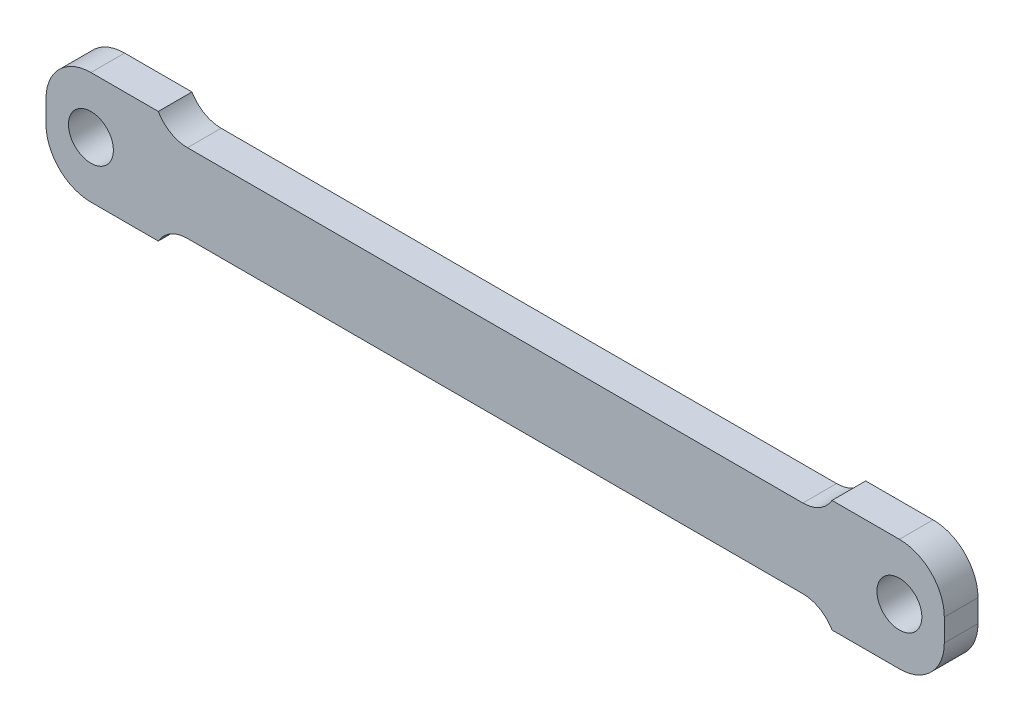
ISO-10303-21;
HEADER;
FILE_DESCRIPTION(('STEP AP214'),'2;1');
FILE_NAME('part.step','',(''),(''),'','','');
FILE_SCHEMA(('AUTOMOTIVE_DESIGN { 1 0 10303 214 1 1 1 1 }'));
ENDSEC;
DATA;
#1=APPLICATION_CONTEXT('core data for automotive mechanical design processes');
#2=APPLICATION_PROTOCOL_DEFINITION('international standard','automotive_design',2000,#1);
#3=PRODUCT_CONTEXT('',#1,'mechanical');
#4=PRODUCT('Part','Part','',(#3));
#5=PRODUCT_RELATED_PRODUCT_CATEGORY('part','',(#4));
#6=PRODUCT_DEFINITION_FORMATION('','',#4);
#7=PRODUCT_DEFINITION_CONTEXT('part definition',#1,'design');
#8=PRODUCT_DEFINITION('design','',#6,#7);
#9=PRODUCT_DEFINITION_SHAPE('','',#8);
#10=(LENGTH_UNIT() NAMED_UNIT(*) SI_UNIT(.MILLI.,.METRE.));
#11=(NAMED_UNIT(*) PLANE_ANGLE_UNIT() SI_UNIT($,.RADIAN.));
#12=(NAMED_UNIT(*) SI_UNIT($,.STERADIAN.) SOLID_ANGLE_UNIT());
#13=UNCERTAINTY_MEASURE_WITH_UNIT(LENGTH_MEASURE(1.E-05),#10,'distance_accuracy_value','');
#14=(GEOMETRIC_REPRESENTATION_CONTEXT(3) GLOBAL_UNCERTAINTY_ASSIGNED_CONTEXT((#13)) GLOBAL_UNIT_ASSIGNED_CONTEXT((#10,
#11,#12)) REPRESENTATION_CONTEXT('',''));
#15=CARTESIAN_POINT('',(0.,0.,0.));
#16=DIRECTION('',(0.,0.,1.));
#17=DIRECTION('',(1.,0.,0.));
#18=AXIS2_PLACEMENT_3D('',#15,#16,#17);
#19=CARTESIAN_POINT('',(-18.,-2.5,1.5));
#20=DIRECTION('',(0.,1.,0.));
#21=DIRECTION('',(0.,0.,1.));
#22=AXIS2_PLACEMENT_3D('',#19,#20,#21);
#23=PLANE('',#22);
#24=DIRECTION('',(1.,0.,0.));
#25=VECTOR('',#24,1.);
#26=CARTESIAN_POINT('',(-18.,-2.5,0.));
#27=LINE('',#26,#25);
#28=CARTESIAN_POINT('',(-18.,-2.5,0.));
#29=VERTEX_POINT('',#28);
#30=CARTESIAN_POINT('',(-15.,-2.5,0.));
#31=VERTEX_POINT('',#30);
#32=EDGE_CURVE('E290',#29,#31,#27,.T.);
#33=ORIENTED_EDGE('',*,*,#32,.T.);
#34=DIRECTION('',(0.,0.,1.));
#35=VECTOR('',#34,1.);
#36=CARTESIAN_POINT('',(-15.,-2.5,1.5));
#37=LINE('',#36,#35);
#38=CARTESIAN_POINT('',(-15.,-2.5,1.5));
#39=VERTEX_POINT('',#38);
#40=EDGE_CURVE('E213',#31,#39,#37,.T.);
#41=ORIENTED_EDGE('',*,*,#40,.T.);
#42=DIRECTION('',(1.,0.,0.));
#43=VECTOR('',#42,1.);
#44=CARTESIAN_POINT('',(-18.,-2.5,1.5));
#45=LINE('',#44,#43);
#46=CARTESIAN_POINT('',(-18.,-2.5,1.5));
#47=VERTEX_POINT('',#46);
#48=EDGE_CURVE('E246',#47,#39,#45,.T.);
#49=ORIENTED_EDGE('',*,*,#48,.F.);
#50=DIRECTION('',(0.,0.,-1.));
#51=VECTOR('',#50,1.);
#52=CARTESIAN_POINT('',(-18.,-2.5,1.5));
#53=LINE('',#52,#51);
#54=EDGE_CURVE('E207',#47,#29,#53,.T.);
#55=ORIENTED_EDGE('',*,*,#54,.T.);
#56=EDGE_LOOP('',(#33,#41,#49,#55));
#57=FACE_BOUND('',#56,.T.);
#58=ADVANCED_FACE('F36',(#57),#23,.F.);
#59=CARTESIAN_POINT('',(-18.,2.5,1.5));
#60=DIRECTION('',(0.,-1.,0.));
#61=DIRECTION('',(0.,0.,-1.));
#62=AXIS2_PLACEMENT_3D('',#59,#60,#61);
#63=PLANE('',#62);
#64=DIRECTION('',(-1.,0.,0.));
#65=VECTOR('',#64,1.);
#66=CARTESIAN_POINT('',(-18.,2.5,1.5));
#67=LINE('',#66,#65);
#68=CARTESIAN_POINT('',(-15.,2.5,1.5));
#69=VERTEX_POINT('',#68);
#70=CARTESIAN_POINT('',(-18.,2.5,1.5));
#71=VERTEX_POINT('',#70);
#72=EDGE_CURVE('E165',#69,#71,#67,.T.);
#73=ORIENTED_EDGE('',*,*,#72,.F.);
#74=DIRECTION('',(0.,0.,-1.));
#75=VECTOR('',#74,1.);
#76=CARTESIAN_POINT('',(-15.,2.5,1.5));
#77=LINE('',#76,#75);
#78=CARTESIAN_POINT('',(-15.,2.5,0.));
#79=VERTEX_POINT('',#78);
#80=EDGE_CURVE('E152',#69,#79,#77,.T.);
#81=ORIENTED_EDGE('',*,*,#80,.T.);
#82=DIRECTION('',(-1.,0.,0.));
#83=VECTOR('',#82,1.);
#84=CARTESIAN_POINT('',(-18.,2.5,0.));
#85=LINE('',#84,#83);
#86=CARTESIAN_POINT('',(-18.,2.5,0.));
#87=VERTEX_POINT('',#86);
#88=EDGE_CURVE('E163',#79,#87,#85,.T.);
#89=ORIENTED_EDGE('',*,*,#88,.T.);
#90=DIRECTION('',(0.,0.,-1.));
#91=VECTOR('',#90,1.);
#92=CARTESIAN_POINT('',(-18.,2.5,1.5));
#93=LINE('',#92,#91);
#94=EDGE_CURVE('E193',#71,#87,#93,.T.);
#95=ORIENTED_EDGE('',*,*,#94,.F.);
#96=EDGE_LOOP('',(#73,#81,#89,#95));
#97=FACE_BOUND('',#96,.T.);
#98=ADVANCED_FACE('F161',(#97),#63,.F.);
#99=CARTESIAN_POINT('',(-18.,-0.5,1.5));
#100=DIRECTION('',(0.,0.,1.));
#101=DIRECTION('',(1.,0.,0.));
#102=AXIS2_PLACEMENT_3D('',#99,#100,#101);
#103=PLANE('',#102);
#104=DIRECTION('',(-1.,0.,0.));
#105=VECTOR('',#104,1.);
#106=CARTESIAN_POINT('',(15.,1.75,1.5));
#107=LINE('',#106,#105);
#108=CARTESIAN_POINT('',(13.7009618943233,1.75,1.5));
#109=VERTEX_POINT('',#108);
#110=CARTESIAN_POINT('',(-13.7009618943233,1.75,1.5));
#111=VERTEX_POINT('',#110);
#112=EDGE_CURVE('E267',#109,#111,#107,.T.);
#113=ORIENTED_EDGE('',*,*,#112,.T.);
#114=CARTESIAN_POINT('',(-13.7009618943233,3.25,1.5));
#115=DIRECTION('',(0.,0.,1.));
#116=DIRECTION('',(1.,0.,0.));
#117=AXIS2_PLACEMENT_3D('',#114,#115,#116);
#118=CIRCLE('',#117,1.5);
#119=EDGE_CURVE('E11',#111,#69,#118,.F.);
#120=ORIENTED_EDGE('',*,*,#119,.T.);
#121=ORIENTED_EDGE('',*,*,#72,.T.);
#122=CARTESIAN_POINT('',(-18.,0.5,1.5));
#123=DIRECTION('',(0.,0.,1.));
#124=DIRECTION('',(1.,0.,0.));
#125=AXIS2_PLACEMENT_3D('',#122,#123,#124);
#126=CIRCLE('',#125,2.);
#127=CARTESIAN_POINT('',(-20.,0.499999999999986,1.5));
#128=VERTEX_POINT('',#127);
#129=EDGE_CURVE('E285',#71,#128,#126,.T.);
#130=ORIENTED_EDGE('',*,*,#129,.T.);
#131=DIRECTION('',(0.,-1.,0.));
#132=VECTOR('',#131,1.);
#133=CARTESIAN_POINT('',(-20.,0.499999999999986,1.5));
#134=LINE('',#133,#132);
#135=CARTESIAN_POINT('',(-20.,-0.499999999999986,1.5));
#136=VERTEX_POINT('',#135);
#137=EDGE_CURVE('E190',#128,#136,#134,.T.);
#138=ORIENTED_EDGE('',*,*,#137,.T.);
#139=CARTESIAN_POINT('',(-18.,-0.5,1.5));
#140=DIRECTION('',(0.,0.,1.));
#141=DIRECTION('',(1.,0.,0.));
#142=AXIS2_PLACEMENT_3D('',#139,#140,#141);
#143=CIRCLE('',#142,2.);
#144=EDGE_CURVE('E185',#136,#47,#143,.T.);
#145=ORIENTED_EDGE('',*,*,#144,.T.);
#146=ORIENTED_EDGE('',*,*,#48,.T.);
#147=CARTESIAN_POINT('',(-13.7009618943233,-3.25,1.5));
#148=DIRECTION('',(0.,0.,1.));
#149=DIRECTION('',(1.,0.,0.));
#150=AXIS2_PLACEMENT_3D('',#147,#148,#149);
#151=CIRCLE('',#150,1.5);
#152=CARTESIAN_POINT('',(-13.7009618943233,-1.75,1.5));
#153=VERTEX_POINT('',#152);
#154=EDGE_CURVE('E58',#39,#153,#151,.F.);
#155=ORIENTED_EDGE('',*,*,#154,.T.);
#156=DIRECTION('',(1.,0.,0.));
#157=VECTOR('',#156,1.);
#158=CARTESIAN_POINT('',(15.,-1.75,1.5));
#159=LINE('',#158,#157);
#160=CARTESIAN_POINT('',(13.7009618943234,-1.75,1.5));
#161=VERTEX_POINT('',#160);
#162=EDGE_CURVE('E239',#153,#161,#159,.T.);
#163=ORIENTED_EDGE('',*,*,#162,.T.);
#164=CARTESIAN_POINT('',(13.7009618943234,-3.25,1.5));
#165=DIRECTION('',(0.,0.,1.));
#166=DIRECTION('',(1.,0.,0.));
#167=AXIS2_PLACEMENT_3D('',#164,#165,#166);
#168=CIRCLE('',#167,1.5);
#169=CARTESIAN_POINT('',(15.,-2.5,1.5));
#170=VERTEX_POINT('',#169);
#171=EDGE_CURVE('E158',#161,#170,#168,.F.);
#172=ORIENTED_EDGE('',*,*,#171,.T.);
#173=CARTESIAN_POINT('',(18.,-2.5,1.5));
#174=VERTEX_POINT('',#173);
#175=EDGE_CURVE('E237',#170,#174,#45,.T.);
#176=ORIENTED_EDGE('',*,*,#175,.T.);
#177=CARTESIAN_POINT('',(18.,-0.5,1.5));
#178=DIRECTION('',(0.,0.,1.));
#179=DIRECTION('',(1.,0.,0.));
#180=AXIS2_PLACEMENT_3D('',#177,#178,#179);
#181=CIRCLE('',#180,2.);
#182=CARTESIAN_POINT('',(20.,-0.499999999999986,1.5));
#183=VERTEX_POINT('',#182);
#184=EDGE_CURVE('E276',#174,#183,#181,.T.);
#185=ORIENTED_EDGE('',*,*,#184,.T.);
#186=DIRECTION('',(0.,1.,0.));
#187=VECTOR('',#186,1.);
#188=CARTESIAN_POINT('',(20.,0.499999999999986,1.5));
#189=LINE('',#188,#187);
#190=CARTESIAN_POINT('',(20.,0.499999999999986,1.5));
#191=VERTEX_POINT('',#190);
#192=EDGE_CURVE('E278',#183,#191,#189,.T.);
#193=ORIENTED_EDGE('',*,*,#192,.T.);
#194=CARTESIAN_POINT('',(18.,0.5,1.5));
#195=DIRECTION('',(0.,0.,1.));
#196=DIRECTION('',(-1.,0.,0.));
#197=AXIS2_PLACEMENT_3D('',#194,#195,#196);
#198=CIRCLE('',#197,2.);
#199=CARTESIAN_POINT('',(18.,2.5,1.5));
#200=VERTEX_POINT('',#199);
#201=EDGE_CURVE('E280',#191,#200,#198,.T.);
#202=ORIENTED_EDGE('',*,*,#201,.T.);
#203=CARTESIAN_POINT('',(15.,2.5,1.5));
#204=VERTEX_POINT('',#203);
#205=EDGE_CURVE('E282',#200,#204,#67,.T.);
#206=ORIENTED_EDGE('',*,*,#205,.T.);
#207=CARTESIAN_POINT('',(13.7009618943233,3.25,1.5));
#208=DIRECTION('',(0.,0.,1.));
#209=DIRECTION('',(1.,0.,0.));
#210=AXIS2_PLACEMENT_3D('',#207,#208,#209);
#211=CIRCLE('',#210,1.5);
#212=EDGE_CURVE('E225',#204,#109,#211,.F.);
#213=ORIENTED_EDGE('',*,*,#212,.T.);
#214=EDGE_LOOP('',(#113,#120,#121,#130,#138,#145,#146,#155,#163,#172,#176,#185,#193,#202,#206,#213));
#215=FACE_BOUND('',#214,.T.);
#216=CARTESIAN_POINT('',(18.,0.,1.5));
#217=DIRECTION('',(0.,0.,1.));
#218=DIRECTION('',(1.,0.,0.));
#219=AXIS2_PLACEMENT_3D('',#216,#217,#218);
#220=CIRCLE('',#219,1.);
#221=CARTESIAN_POINT('',(19.,0.,1.5));
#222=VERTEX_POINT('',#221);
#223=EDGE_CURVE('E268',#222,#222,#220,.T.);
#224=ORIENTED_EDGE('',*,*,#223,.F.);
#225=EDGE_LOOP('',(#224));
#226=FACE_BOUND('',#225,.T.);
#227=CARTESIAN_POINT('',(-18.,0.,1.5));
#228=DIRECTION('',(0.,0.,1.));
#229=DIRECTION('',(1.,0.,0.));
#230=AXIS2_PLACEMENT_3D('',#227,#228,#229);
#231=CIRCLE('',#230,1.);
#232=CARTESIAN_POINT('',(-17.,0.,1.5));
#233=VERTEX_POINT('',#232);
#234=EDGE_CURVE('E260',#233,#233,#231,.T.);
#235=ORIENTED_EDGE('',*,*,#234,.F.);
#236=EDGE_LOOP('',(#235));
#237=FACE_BOUND('',#236,.T.);
#238=ADVANCED_FACE('F235',(#215,#226,#237),#103,.T.);
#239=CARTESIAN_POINT('',(-18.,-0.5,0.));
#240=DIRECTION('',(0.,0.,1.));
#241=DIRECTION('',(1.,0.,0.));
#242=AXIS2_PLACEMENT_3D('',#239,#240,#241);
#243=PLANE('',#242);
#244=ORIENTED_EDGE('',*,*,#88,.F.);
#245=CARTESIAN_POINT('',(-13.7009618943233,3.25,0.));
#246=DIRECTION('',(0.,0.,1.));
#247=DIRECTION('',(1.,0.,0.));
#248=AXIS2_PLACEMENT_3D('',#245,#246,#247);
#249=CIRCLE('',#248,1.5);
#250=CARTESIAN_POINT('',(-13.7009618943233,1.75,0.));
#251=VERTEX_POINT('',#250);
#252=EDGE_CURVE('E44',#79,#251,#249,.T.);
#253=ORIENTED_EDGE('',*,*,#252,.T.);
#254=DIRECTION('',(-1.,0.,0.));
#255=VECTOR('',#254,1.);
#256=CARTESIAN_POINT('',(15.,1.75,0.));
#257=LINE('',#256,#255);
#258=CARTESIAN_POINT('',(13.7009618943233,1.75,0.));
#259=VERTEX_POINT('',#258);
#260=EDGE_CURVE('E256',#259,#251,#257,.T.);
#261=ORIENTED_EDGE('',*,*,#260,.F.);
#262=CARTESIAN_POINT('',(13.7009618943233,3.25,0.));
#263=DIRECTION('',(0.,0.,1.));
#264=DIRECTION('',(1.,0.,0.));
#265=AXIS2_PLACEMENT_3D('',#262,#263,#264);
#266=CIRCLE('',#265,1.5);
#267=CARTESIAN_POINT('',(15.,2.5,0.));
#268=VERTEX_POINT('',#267);
#269=EDGE_CURVE('E223',#259,#268,#266,.T.);
#270=ORIENTED_EDGE('',*,*,#269,.T.);
#271=CARTESIAN_POINT('',(18.,2.5,0.));
#272=VERTEX_POINT('',#271);
#273=EDGE_CURVE('E174',#272,#268,#85,.T.);
#274=ORIENTED_EDGE('',*,*,#273,.F.);
#275=CARTESIAN_POINT('',(18.,0.5,0.));
#276=DIRECTION('',(0.,0.,1.));
#277=DIRECTION('',(-1.,0.,0.));
#278=AXIS2_PLACEMENT_3D('',#275,#276,#277);
#279=CIRCLE('',#278,2.);
#280=CARTESIAN_POINT('',(20.,0.499999999999986,0.));
#281=VERTEX_POINT('',#280);
#282=EDGE_CURVE('E175',#281,#272,#279,.T.);
#283=ORIENTED_EDGE('',*,*,#282,.F.);
#284=DIRECTION('',(0.,1.,0.));
#285=VECTOR('',#284,1.);
#286=CARTESIAN_POINT('',(20.,0.499999999999986,0.));
#287=LINE('',#286,#285);
#288=CARTESIAN_POINT('',(20.,-0.499999999999986,0.));
#289=VERTEX_POINT('',#288);
#290=EDGE_CURVE('E178',#289,#281,#287,.T.);
#291=ORIENTED_EDGE('',*,*,#290,.F.);
#292=CARTESIAN_POINT('',(18.,-0.5,0.));
#293=DIRECTION('',(0.,0.,1.));
#294=DIRECTION('',(1.,0.,0.));
#295=AXIS2_PLACEMENT_3D('',#292,#293,#294);
#296=CIRCLE('',#295,2.);
#297=CARTESIAN_POINT('',(18.,-2.5,0.));
#298=VERTEX_POINT('',#297);
#299=EDGE_CURVE('E293',#298,#289,#296,.T.);
#300=ORIENTED_EDGE('',*,*,#299,.F.);
#301=CARTESIAN_POINT('',(15.,-2.5,0.));
#302=VERTEX_POINT('',#301);
#303=EDGE_CURVE('E252',#302,#298,#27,.T.);
#304=ORIENTED_EDGE('',*,*,#303,.F.);
#305=CARTESIAN_POINT('',(13.7009618943234,-3.25,0.));
#306=DIRECTION('',(0.,0.,1.));
#307=DIRECTION('',(1.,0.,0.));
#308=AXIS2_PLACEMENT_3D('',#305,#306,#307);
#309=CIRCLE('',#308,1.5);
#310=CARTESIAN_POINT('',(13.7009618943234,-1.75,0.));
#311=VERTEX_POINT('',#310);
#312=EDGE_CURVE('E230',#302,#311,#309,.T.);
#313=ORIENTED_EDGE('',*,*,#312,.T.);
#314=DIRECTION('',(1.,0.,0.));
#315=VECTOR('',#314,1.);
#316=CARTESIAN_POINT('',(15.,-1.75,0.));
#317=LINE('',#316,#315);
#318=CARTESIAN_POINT('',(-13.7009618943233,-1.75,0.));
#319=VERTEX_POINT('',#318);
#320=EDGE_CURVE('E250',#319,#311,#317,.T.);
#321=ORIENTED_EDGE('',*,*,#320,.F.);
#322=CARTESIAN_POINT('',(-13.7009618943233,-3.25,0.));
#323=DIRECTION('',(0.,0.,1.));
#324=DIRECTION('',(1.,0.,0.));
#325=AXIS2_PLACEMENT_3D('',#322,#323,#324);
#326=CIRCLE('',#325,1.5);
#327=EDGE_CURVE('E227',#319,#31,#326,.T.);
#328=ORIENTED_EDGE('',*,*,#327,.T.);
#329=ORIENTED_EDGE('',*,*,#32,.F.);
#330=CARTESIAN_POINT('',(-18.,-0.5,0.));
#331=DIRECTION('',(0.,0.,1.));
#332=DIRECTION('',(1.,0.,0.));
#333=AXIS2_PLACEMENT_3D('',#330,#331,#332);
#334=CIRCLE('',#333,2.);
#335=CARTESIAN_POINT('',(-20.,-0.499999999999986,0.));
#336=VERTEX_POINT('',#335);
#337=EDGE_CURVE('E271',#336,#29,#334,.T.);
#338=ORIENTED_EDGE('',*,*,#337,.F.);
#339=DIRECTION('',(0.,-1.,0.));
#340=VECTOR('',#339,1.);
#341=CARTESIAN_POINT('',(-20.,0.499999999999986,0.));
#342=LINE('',#341,#340);
#343=CARTESIAN_POINT('',(-20.,0.499999999999986,0.));
#344=VERTEX_POINT('',#343);
#345=EDGE_CURVE('E183',#344,#336,#342,.T.);
#346=ORIENTED_EDGE('',*,*,#345,.F.);
#347=CARTESIAN_POINT('',(-18.,0.5,0.));
#348=DIRECTION('',(0.,0.,1.));
#349=DIRECTION('',(1.,0.,0.));
#350=AXIS2_PLACEMENT_3D('',#347,#348,#349);
#351=CIRCLE('',#350,2.);
#352=EDGE_CURVE('E173',#87,#344,#351,.T.);
#353=ORIENTED_EDGE('',*,*,#352,.F.);
#354=EDGE_LOOP('',(#244,#253,#261,#270,#274,#283,#291,#300,#304,#313,#321,#328,#329,#338,#346,#353));
#355=FACE_BOUND('',#354,.T.);
#356=CARTESIAN_POINT('',(18.,0.,0.));
#357=DIRECTION('',(0.,0.,1.));
#358=DIRECTION('',(1.,0.,0.));
#359=AXIS2_PLACEMENT_3D('',#356,#357,#358);
#360=CIRCLE('',#359,1.);
#361=CARTESIAN_POINT('',(19.,0.,0.));
#362=VERTEX_POINT('',#361);
#363=EDGE_CURVE('E263',#362,#362,#360,.T.);
#364=ORIENTED_EDGE('',*,*,#363,.T.);
#365=EDGE_LOOP('',(#364));
#366=FACE_BOUND('',#365,.T.);
#367=CARTESIAN_POINT('',(-18.,0.,0.));
#368=DIRECTION('',(0.,0.,1.));
#369=DIRECTION('',(1.,0.,0.));
#370=AXIS2_PLACEMENT_3D('',#367,#368,#369);
#371=CIRCLE('',#370,1.);
#372=CARTESIAN_POINT('',(-17.,0.,0.));
#373=VERTEX_POINT('',#372);
#374=EDGE_CURVE('E264',#373,#373,#371,.T.);
#375=ORIENTED_EDGE('',*,*,#374,.T.);
#376=EDGE_LOOP('',(#375));
#377=FACE_BOUND('',#376,.T.);
#378=ADVANCED_FACE('F170',(#355,#366,#377),#243,.F.);
#379=CARTESIAN_POINT('',(-18.,-0.5,1.5));
#380=DIRECTION('',(0.,0.,-1.));
#381=DIRECTION('',(-1.,0.,0.));
#382=AXIS2_PLACEMENT_3D('',#379,#380,#381);
#383=CYLINDRICAL_SURFACE('',#382,2.);
#384=ORIENTED_EDGE('',*,*,#337,.T.);
#385=ORIENTED_EDGE('',*,*,#54,.F.);
#386=ORIENTED_EDGE('',*,*,#144,.F.);
#387=DIRECTION('',(0.,0.,-1.));
#388=VECTOR('',#387,1.);
#389=CARTESIAN_POINT('',(-20.,-0.499999999999986,1.5));
#390=LINE('',#389,#388);
#391=EDGE_CURVE('E186',#136,#336,#390,.T.);
#392=ORIENTED_EDGE('',*,*,#391,.T.);
#393=EDGE_LOOP('',(#384,#385,#386,#392));
#394=FACE_BOUND('',#393,.T.);
#395=ADVANCED_FACE('F340',(#394),#383,.T.);
#396=ORIENTED_EDGE('',*,*,#175,.F.);
#397=DIRECTION('',(0.,0.,-1.));
#398=VECTOR('',#397,1.);
#399=CARTESIAN_POINT('',(15.,-2.5,1.5));
#400=LINE('',#399,#398);
#401=EDGE_CURVE('E166',#170,#302,#400,.T.);
#402=ORIENTED_EDGE('',*,*,#401,.T.);
#403=ORIENTED_EDGE('',*,*,#303,.T.);
#404=DIRECTION('',(0.,0.,-1.));
#405=VECTOR('',#404,1.);
#406=CARTESIAN_POINT('',(18.,-2.5,1.5));
#407=LINE('',#406,#405);
#408=EDGE_CURVE('E204',#174,#298,#407,.T.);
#409=ORIENTED_EDGE('',*,*,#408,.F.);
#410=EDGE_LOOP('',(#396,#402,#403,#409));
#411=FACE_BOUND('',#410,.T.);
#412=ADVANCED_FACE('F243',(#411),#23,.F.);
#413=CARTESIAN_POINT('',(18.,-0.5,1.5));
#414=DIRECTION('',(0.,0.,-1.));
#415=DIRECTION('',(-1.,0.,0.));
#416=AXIS2_PLACEMENT_3D('',#413,#414,#415);
#417=CYLINDRICAL_SURFACE('',#416,2.);
#418=ORIENTED_EDGE('',*,*,#299,.T.);
#419=DIRECTION('',(0.,0.,-1.));
#420=VECTOR('',#419,1.);
#421=CARTESIAN_POINT('',(20.,-0.499999999999986,1.5));
#422=LINE('',#421,#420);
#423=EDGE_CURVE('E201',#183,#289,#422,.T.);
#424=ORIENTED_EDGE('',*,*,#423,.F.);
#425=ORIENTED_EDGE('',*,*,#184,.F.);
#426=ORIENTED_EDGE('',*,*,#408,.T.);
#427=EDGE_LOOP('',(#418,#424,#425,#426));
#428=FACE_BOUND('',#427,.T.);
#429=ADVANCED_FACE('F339',(#428),#417,.T.);
#430=CARTESIAN_POINT('',(20.,0.499999999999986,1.5));
#431=DIRECTION('',(-1.,0.,0.));
#432=DIRECTION('',(0.,0.,1.));
#433=AXIS2_PLACEMENT_3D('',#430,#431,#432);
#434=PLANE('',#433);
#435=ORIENTED_EDGE('',*,*,#290,.T.);
#436=DIRECTION('',(0.,0.,-1.));
#437=VECTOR('',#436,1.);
#438=CARTESIAN_POINT('',(20.,0.499999999999986,1.5));
#439=LINE('',#438,#437);
#440=EDGE_CURVE('E198',#191,#281,#439,.T.);
#441=ORIENTED_EDGE('',*,*,#440,.F.);
#442=ORIENTED_EDGE('',*,*,#192,.F.);
#443=ORIENTED_EDGE('',*,*,#423,.T.);
#444=EDGE_LOOP('',(#435,#441,#442,#443));
#445=FACE_BOUND('',#444,.T.);
#446=ADVANCED_FACE('F297',(#445),#434,.F.);
#447=CARTESIAN_POINT('',(18.,0.5,1.5));
#448=DIRECTION('',(0.,0.,-1.));
#449=DIRECTION('',(-1.,0.,0.));
#450=AXIS2_PLACEMENT_3D('',#447,#448,#449);
#451=CYLINDRICAL_SURFACE('',#450,2.);
#452=ORIENTED_EDGE('',*,*,#282,.T.);
#453=DIRECTION('',(0.,0.,-1.));
#454=VECTOR('',#453,1.);
#455=CARTESIAN_POINT('',(18.,2.5,1.5));
#456=LINE('',#455,#454);
#457=EDGE_CURVE('E195',#200,#272,#456,.T.);
#458=ORIENTED_EDGE('',*,*,#457,.F.);
#459=ORIENTED_EDGE('',*,*,#201,.F.);
#460=ORIENTED_EDGE('',*,*,#440,.T.);
#461=EDGE_LOOP('',(#452,#458,#459,#460));
#462=FACE_BOUND('',#461,.T.);
#463=ADVANCED_FACE('F303',(#462),#451,.T.);
#464=ORIENTED_EDGE('',*,*,#273,.T.);
#465=DIRECTION('',(0.,0.,1.));
#466=VECTOR('',#465,1.);
#467=CARTESIAN_POINT('',(15.,2.5,1.5));
#468=LINE('',#467,#466);
#469=EDGE_CURVE('E167',#268,#204,#468,.T.);
#470=ORIENTED_EDGE('',*,*,#469,.T.);
#471=ORIENTED_EDGE('',*,*,#205,.F.);
#472=ORIENTED_EDGE('',*,*,#457,.T.);
#473=EDGE_LOOP('',(#464,#470,#471,#472));
#474=FACE_BOUND('',#473,.T.);
#475=ADVANCED_FACE('F308',(#474),#63,.F.);
#476=CARTESIAN_POINT('',(-18.,0.5,1.5));
#477=DIRECTION('',(0.,0.,-1.));
#478=DIRECTION('',(-1.,0.,0.));
#479=AXIS2_PLACEMENT_3D('',#476,#477,#478);
#480=CYLINDRICAL_SURFACE('',#479,2.);
#481=ORIENTED_EDGE('',*,*,#352,.T.);
#482=DIRECTION('',(0.,0.,-1.));
#483=VECTOR('',#482,1.);
#484=CARTESIAN_POINT('',(-20.,0.499999999999986,1.5));
#485=LINE('',#484,#483);
#486=EDGE_CURVE('E189',#128,#344,#485,.T.);
#487=ORIENTED_EDGE('',*,*,#486,.F.);
#488=ORIENTED_EDGE('',*,*,#129,.F.);
#489=ORIENTED_EDGE('',*,*,#94,.T.);
#490=EDGE_LOOP('',(#481,#487,#488,#489));
#491=FACE_BOUND('',#490,.T.);
#492=ADVANCED_FACE('F398',(#491),#480,.T.);
#493=CARTESIAN_POINT('',(-20.,0.499999999999986,1.5));
#494=DIRECTION('',(1.,0.,0.));
#495=DIRECTION('',(0.,0.,-1.));
#496=AXIS2_PLACEMENT_3D('',#493,#494,#495);
#497=PLANE('',#496);
#498=ORIENTED_EDGE('',*,*,#345,.T.);
#499=ORIENTED_EDGE('',*,*,#391,.F.);
#500=ORIENTED_EDGE('',*,*,#137,.F.);
#501=ORIENTED_EDGE('',*,*,#486,.T.);
#502=EDGE_LOOP('',(#498,#499,#500,#501));
#503=FACE_BOUND('',#502,.T.);
#504=ADVANCED_FACE('F446',(#503),#497,.F.);
#505=CARTESIAN_POINT('',(18.,0.,1.5));
#506=DIRECTION('',(0.,0.,-1.));
#507=DIRECTION('',(-1.,0.,0.));
#508=AXIS2_PLACEMENT_3D('',#505,#506,#507);
#509=CYLINDRICAL_SURFACE('',#508,1.);
#510=ORIENTED_EDGE('',*,*,#223,.T.);
#511=EDGE_LOOP('',(#510));
#512=FACE_BOUND('',#511,.T.);
#513=ORIENTED_EDGE('',*,*,#363,.F.);
#514=EDGE_LOOP('',(#513));
#515=FACE_BOUND('',#514,.T.);
#516=ADVANCED_FACE('F326',(#512,#515),#509,.F.);
#517=CARTESIAN_POINT('',(-18.,0.,1.5));
#518=DIRECTION('',(0.,0.,-1.));
#519=DIRECTION('',(-1.,0.,0.));
#520=AXIS2_PLACEMENT_3D('',#517,#518,#519);
#521=CYLINDRICAL_SURFACE('',#520,1.);
#522=ORIENTED_EDGE('',*,*,#234,.T.);
#523=EDGE_LOOP('',(#522));
#524=FACE_BOUND('',#523,.T.);
#525=ORIENTED_EDGE('',*,*,#374,.F.);
#526=EDGE_LOOP('',(#525));
#527=FACE_BOUND('',#526,.T.);
#528=ADVANCED_FACE('F319',(#524,#527),#521,.F.);
#529=CARTESIAN_POINT('',(15.,1.75,1.5));
#530=DIRECTION('',(0.,-1.,0.));
#531=DIRECTION('',(0.,0.,-1.));
#532=AXIS2_PLACEMENT_3D('',#529,#530,#531);
#533=PLANE('',#532);
#534=ORIENTED_EDGE('',*,*,#112,.F.);
#535=DIRECTION('',(0.,0.,-1.));
#536=VECTOR('',#535,1.);
#537=CARTESIAN_POINT('',(13.7009618943233,1.75,1.5));
#538=LINE('',#537,#536);
#539=EDGE_CURVE('E216',#109,#259,#538,.T.);
#540=ORIENTED_EDGE('',*,*,#539,.T.);
#541=ORIENTED_EDGE('',*,*,#260,.T.);
#542=DIRECTION('',(0.,0.,1.));
#543=VECTOR('',#542,1.);
#544=CARTESIAN_POINT('',(-13.7009618943233,1.75,1.5));
#545=LINE('',#544,#543);
#546=EDGE_CURVE('E153',#251,#111,#545,.T.);
#547=ORIENTED_EDGE('',*,*,#546,.T.);
#548=EDGE_LOOP('',(#534,#540,#541,#547));
#549=FACE_BOUND('',#548,.T.);
#550=ADVANCED_FACE('F316',(#549),#533,.F.);
#551=CARTESIAN_POINT('',(15.,-1.75,1.5));
#552=DIRECTION('',(0.,1.,0.));
#553=DIRECTION('',(0.,0.,1.));
#554=AXIS2_PLACEMENT_3D('',#551,#552,#553);
#555=PLANE('',#554);
#556=ORIENTED_EDGE('',*,*,#162,.F.);
#557=DIRECTION('',(0.,0.,-1.));
#558=VECTOR('',#557,1.);
#559=CARTESIAN_POINT('',(-13.7009618943233,-1.75,1.5));
#560=LINE('',#559,#558);
#561=EDGE_CURVE('E220',#153,#319,#560,.T.);
#562=ORIENTED_EDGE('',*,*,#561,.T.);
#563=ORIENTED_EDGE('',*,*,#320,.T.);
#564=DIRECTION('',(0.,0.,1.));
#565=VECTOR('',#564,1.);
#566=CARTESIAN_POINT('',(13.7009618943234,-1.75,1.5));
#567=LINE('',#566,#565);
#568=EDGE_CURVE('E51',#311,#161,#567,.T.);
#569=ORIENTED_EDGE('',*,*,#568,.T.);
#570=EDGE_LOOP('',(#556,#562,#563,#569));
#571=FACE_BOUND('',#570,.T.);
#572=ADVANCED_FACE('F253',(#571),#555,.F.);
#573=CARTESIAN_POINT('',(13.7009618943233,3.25,1.5));
#574=DIRECTION('',(0.,0.,-1.));
#575=DIRECTION('',(-1.,0.,0.));
#576=AXIS2_PLACEMENT_3D('',#573,#574,#575);
#577=CYLINDRICAL_SURFACE('',#576,1.5);
#578=ORIENTED_EDGE('',*,*,#212,.F.);
#579=ORIENTED_EDGE('',*,*,#469,.F.);
#580=ORIENTED_EDGE('',*,*,#269,.F.);
#581=ORIENTED_EDGE('',*,*,#539,.F.);
#582=EDGE_LOOP('',(#578,#579,#580,#581));
#583=FACE_BOUND('',#582,.T.);
#584=ADVANCED_FACE('F312',(#583),#577,.F.);
#585=CARTESIAN_POINT('',(-13.7009618943233,-3.25,1.5));
#586=DIRECTION('',(0.,0.,-1.));
#587=DIRECTION('',(-1.,0.,0.));
#588=AXIS2_PLACEMENT_3D('',#585,#586,#587);
#589=CYLINDRICAL_SURFACE('',#588,1.5);
#590=ORIENTED_EDGE('',*,*,#154,.F.);
#591=ORIENTED_EDGE('',*,*,#40,.F.);
#592=ORIENTED_EDGE('',*,*,#327,.F.);
#593=ORIENTED_EDGE('',*,*,#561,.F.);
#594=EDGE_LOOP('',(#590,#591,#592,#593));
#595=FACE_BOUND('',#594,.T.);
#596=ADVANCED_FACE('F354',(#595),#589,.F.);
#597=CARTESIAN_POINT('',(13.7009618943234,-3.25,1.5));
#598=DIRECTION('',(0.,0.,1.));
#599=DIRECTION('',(1.,0.,0.));
#600=AXIS2_PLACEMENT_3D('',#597,#598,#599);
#601=CYLINDRICAL_SURFACE('',#600,1.5);
#602=ORIENTED_EDGE('',*,*,#171,.F.);
#603=ORIENTED_EDGE('',*,*,#568,.F.);
#604=ORIENTED_EDGE('',*,*,#312,.F.);
#605=ORIENTED_EDGE('',*,*,#401,.F.);
#606=EDGE_LOOP('',(#602,#603,#604,#605));
#607=FACE_BOUND('',#606,.T.);
#608=ADVANCED_FACE('F248',(#607),#601,.F.);
#609=CARTESIAN_POINT('',(-13.7009618943233,3.25,1.5));
#610=DIRECTION('',(0.,0.,1.));
#611=DIRECTION('',(1.,0.,0.));
#612=AXIS2_PLACEMENT_3D('',#609,#610,#611);
#613=CYLINDRICAL_SURFACE('',#612,1.5);
#614=ORIENTED_EDGE('',*,*,#119,.F.);
#615=ORIENTED_EDGE('',*,*,#546,.F.);
#616=ORIENTED_EDGE('',*,*,#252,.F.);
#617=ORIENTED_EDGE('',*,*,#80,.F.);
#618=EDGE_LOOP('',(#614,#615,#616,#617));
#619=FACE_BOUND('',#618,.T.);
#620=ADVANCED_FACE('F38',(#619),#613,.F.);
#621=CLOSED_SHELL('',(#58,#98,#238,#378,#395,#412,#429,#446,#463,#475,#492,#504,#516,#528,#550,
#572,#584,#596,#608,#620));
#622=MANIFOLD_SOLID_BREP('B2',#621);
#623=ADVANCED_BREP_SHAPE_REPRESENTATION('',(#18,#622),#14);
#624=SHAPE_DEFINITION_REPRESENTATION(#9,#623);
ENDSEC;
END-ISO-10303-21;
